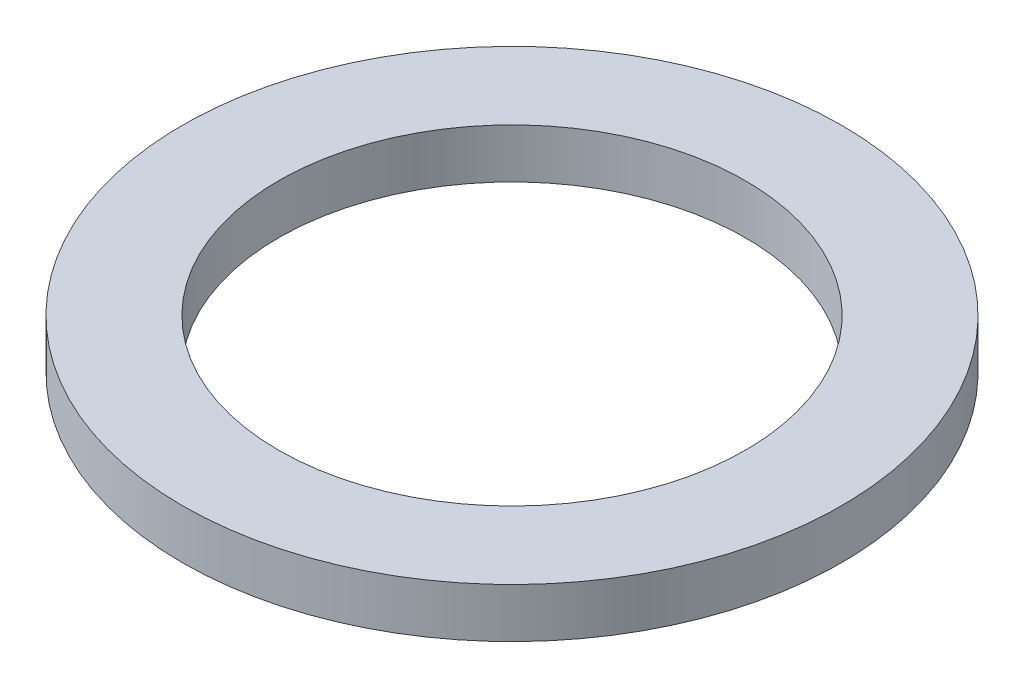
ISO-10303-21;
HEADER;
FILE_DESCRIPTION(('STEP AP214'),'2;1');
FILE_NAME('part.step','',(''),(''),'','','');
FILE_SCHEMA(('AUTOMOTIVE_DESIGN { 1 0 10303 214 1 1 1 1 }'));
ENDSEC;
DATA;
#1=APPLICATION_CONTEXT('core data for automotive mechanical design processes');
#2=APPLICATION_PROTOCOL_DEFINITION('international standard','automotive_design',2000,#1);
#3=PRODUCT_CONTEXT('',#1,'mechanical');
#4=PRODUCT('Part','Part','',(#3));
#5=PRODUCT_RELATED_PRODUCT_CATEGORY('part','',(#4));
#6=PRODUCT_DEFINITION_FORMATION('','',#4);
#7=PRODUCT_DEFINITION_CONTEXT('part definition',#1,'design');
#8=PRODUCT_DEFINITION('design','',#6,#7);
#9=PRODUCT_DEFINITION_SHAPE('','',#8);
#10=(LENGTH_UNIT() NAMED_UNIT(*) SI_UNIT(.MILLI.,.METRE.));
#11=(NAMED_UNIT(*) PLANE_ANGLE_UNIT() SI_UNIT($,.RADIAN.));
#12=(NAMED_UNIT(*) SI_UNIT($,.STERADIAN.) SOLID_ANGLE_UNIT());
#13=UNCERTAINTY_MEASURE_WITH_UNIT(LENGTH_MEASURE(1.E-05),#10,'distance_accuracy_value','');
#14=(GEOMETRIC_REPRESENTATION_CONTEXT(3) GLOBAL_UNCERTAINTY_ASSIGNED_CONTEXT((#13)) GLOBAL_UNIT_ASSIGNED_CONTEXT((#10,
#11,#12)) REPRESENTATION_CONTEXT('',''));
#15=CARTESIAN_POINT('',(0.,0.,0.));
#16=DIRECTION('',(0.,0.,1.));
#17=DIRECTION('',(1.,0.,0.));
#18=AXIS2_PLACEMENT_3D('',#15,#16,#17);
#19=CARTESIAN_POINT('',(0.,9.,0.));
#20=DIRECTION('',(0.,-1.,0.));
#21=DIRECTION('',(0.,0.,-1.));
#22=AXIS2_PLACEMENT_3D('',#19,#20,#21);
#23=CYLINDRICAL_SURFACE('',#22,60.);
#24=CARTESIAN_POINT('',(0.,9.,0.));
#25=DIRECTION('',(0.,1.,0.));
#26=DIRECTION('',(0.,0.,1.));
#27=AXIS2_PLACEMENT_3D('',#24,#25,#26);
#28=CIRCLE('',#27,60.);
#29=CARTESIAN_POINT('',(0.,9.,60.));
#30=VERTEX_POINT('',#29);
#31=EDGE_CURVE('E10',#30,#30,#28,.T.);
#32=ORIENTED_EDGE('',*,*,#31,.F.);
#33=EDGE_LOOP('',(#32));
#34=FACE_BOUND('',#33,.T.);
#35=CARTESIAN_POINT('',(0.,0.,0.));
#36=DIRECTION('',(0.,1.,0.));
#37=DIRECTION('',(0.,0.,1.));
#38=AXIS2_PLACEMENT_3D('',#35,#36,#37);
#39=CIRCLE('',#38,60.);
#40=CARTESIAN_POINT('',(0.,0.,60.));
#41=VERTEX_POINT('',#40);
#42=EDGE_CURVE('E37',#41,#41,#39,.T.);
#43=ORIENTED_EDGE('',*,*,#42,.T.);
#44=EDGE_LOOP('',(#43));
#45=FACE_BOUND('',#44,.T.);
#46=ADVANCED_FACE('F40',(#34,#45),#23,.T.);
#47=CARTESIAN_POINT('',(0.,9.,0.));
#48=DIRECTION('',(0.,1.,0.));
#49=DIRECTION('',(0.,0.,1.));
#50=AXIS2_PLACEMENT_3D('',#47,#48,#49);
#51=PLANE('',#50);
#52=CARTESIAN_POINT('',(0.,9.,0.));
#53=DIRECTION('',(0.,1.,0.));
#54=DIRECTION('',(0.,0.,1.));
#55=AXIS2_PLACEMENT_3D('',#52,#53,#54);
#56=CIRCLE('',#55,42.5);
#57=CARTESIAN_POINT('',(0.,9.,42.5));
#58=VERTEX_POINT('',#57);
#59=EDGE_CURVE('E50',#58,#58,#56,.T.);
#60=ORIENTED_EDGE('',*,*,#59,.F.);
#61=EDGE_LOOP('',(#60));
#62=FACE_BOUND('',#61,.T.);
#63=ORIENTED_EDGE('',*,*,#31,.T.);
#64=EDGE_LOOP('',(#63));
#65=FACE_BOUND('',#64,.T.);
#66=ADVANCED_FACE('F59',(#62,#65),#51,.T.);
#67=CARTESIAN_POINT('',(0.,0.,0.));
#68=DIRECTION('',(0.,1.,0.));
#69=DIRECTION('',(0.,0.,1.));
#70=AXIS2_PLACEMENT_3D('',#67,#68,#69);
#71=PLANE('',#70);
#72=CARTESIAN_POINT('',(0.,0.,0.));
#73=DIRECTION('',(0.,1.,0.));
#74=DIRECTION('',(0.,0.,1.));
#75=AXIS2_PLACEMENT_3D('',#72,#73,#74);
#76=CIRCLE('',#75,42.5);
#77=CARTESIAN_POINT('',(0.,0.,42.5));
#78=VERTEX_POINT('',#77);
#79=EDGE_CURVE('E47',#78,#78,#76,.T.);
#80=ORIENTED_EDGE('',*,*,#79,.T.);
#81=EDGE_LOOP('',(#80));
#82=FACE_BOUND('',#81,.T.);
#83=ORIENTED_EDGE('',*,*,#42,.F.);
#84=EDGE_LOOP('',(#83));
#85=FACE_BOUND('',#84,.T.);
#86=ADVANCED_FACE('F58',(#82,#85),#71,.F.);
#87=CARTESIAN_POINT('',(0.,9.,0.));
#88=DIRECTION('',(0.,-1.,0.));
#89=DIRECTION('',(0.,0.,-1.));
#90=AXIS2_PLACEMENT_3D('',#87,#88,#89);
#91=CYLINDRICAL_SURFACE('',#90,42.5);
#92=ORIENTED_EDGE('',*,*,#59,.T.);
#93=EDGE_LOOP('',(#92));
#94=FACE_BOUND('',#93,.T.);
#95=ORIENTED_EDGE('',*,*,#79,.F.);
#96=EDGE_LOOP('',(#95));
#97=FACE_BOUND('',#96,.T.);
#98=ADVANCED_FACE('F54',(#94,#97),#91,.F.);
#99=CLOSED_SHELL('',(#46,#66,#86,#98));
#100=MANIFOLD_SOLID_BREP('B2',#99);
#101=ADVANCED_BREP_SHAPE_REPRESENTATION('',(#18,#100),#14);
#102=SHAPE_DEFINITION_REPRESENTATION(#9,#101);
ENDSEC;
END-ISO-10303-21;
